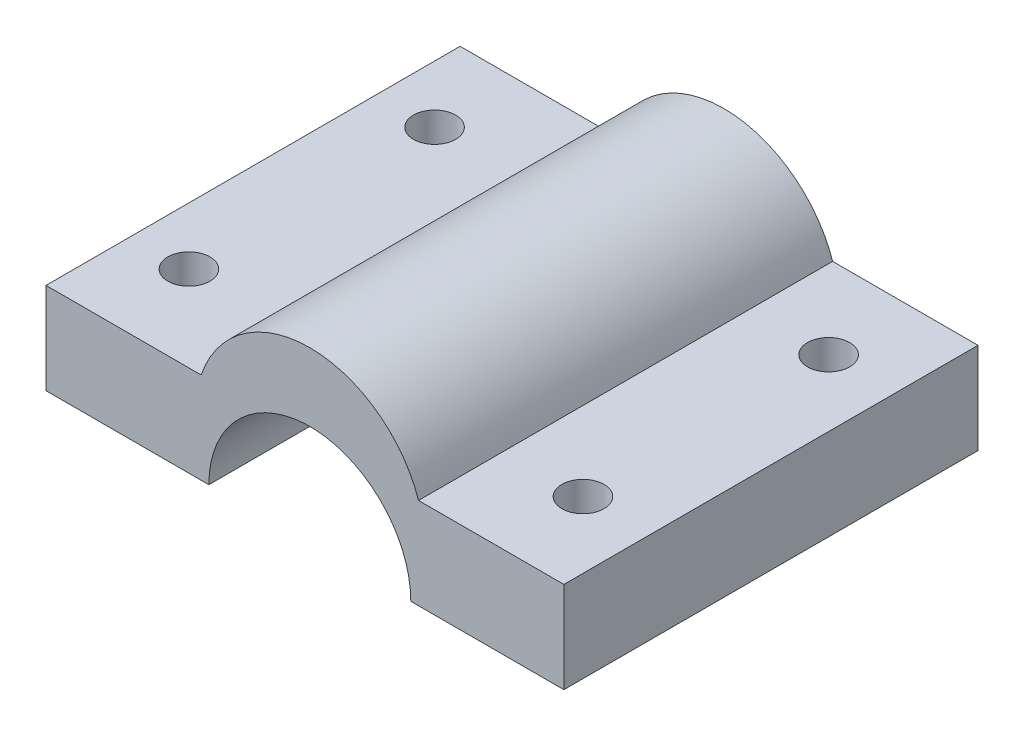
ISO-10303-21;
HEADER;
FILE_DESCRIPTION(('STEP AP214'),'2;1');
FILE_NAME('part.step','',(''),(''),'','','');
FILE_SCHEMA(('AUTOMOTIVE_DESIGN { 1 0 10303 214 1 1 1 1 }'));
ENDSEC;
DATA;
#1=APPLICATION_CONTEXT('core data for automotive mechanical design processes');
#2=APPLICATION_PROTOCOL_DEFINITION('international standard','automotive_design',2000,#1);
#3=PRODUCT_CONTEXT('',#1,'mechanical');
#4=PRODUCT('Part','Part','',(#3));
#5=PRODUCT_RELATED_PRODUCT_CATEGORY('part','',(#4));
#6=PRODUCT_DEFINITION_FORMATION('','',#4);
#7=PRODUCT_DEFINITION_CONTEXT('part definition',#1,'design');
#8=PRODUCT_DEFINITION('design','',#6,#7);
#9=PRODUCT_DEFINITION_SHAPE('','',#8);
#10=(LENGTH_UNIT() NAMED_UNIT(*) SI_UNIT(.MILLI.,.METRE.));
#11=(NAMED_UNIT(*) PLANE_ANGLE_UNIT() SI_UNIT($,.RADIAN.));
#12=(NAMED_UNIT(*) SI_UNIT($,.STERADIAN.) SOLID_ANGLE_UNIT());
#13=UNCERTAINTY_MEASURE_WITH_UNIT(LENGTH_MEASURE(1.E-05),#10,'distance_accuracy_value','');
#14=(GEOMETRIC_REPRESENTATION_CONTEXT(3) GLOBAL_UNCERTAINTY_ASSIGNED_CONTEXT((#13)) GLOBAL_UNIT_ASSIGNED_CONTEXT((#10,
#11,#12)) REPRESENTATION_CONTEXT('',''));
#15=CARTESIAN_POINT('',(0.,0.,0.));
#16=DIRECTION('',(0.,0.,1.));
#17=DIRECTION('',(1.,0.,0.));
#18=AXIS2_PLACEMENT_3D('',#15,#16,#17);
#19=CARTESIAN_POINT('',(-54.4931649896154,-25.7585610200364,50.));
#20=DIRECTION('',(1.,0.,0.));
#21=DIRECTION('',(0.,0.,-1.));
#22=AXIS2_PLACEMENT_3D('',#19,#20,#21);
#23=PLANE('',#22);
#24=DIRECTION('',(0.,-1.,0.));
#25=VECTOR('',#24,1.);
#26=CARTESIAN_POINT('',(-54.4931649896154,-25.7585610200364,0.));
#27=LINE('',#26,#25);
#28=CARTESIAN_POINT('',(-54.4931649896154,-14.7472677595628,0.));
#29=VERTEX_POINT('',#28);
#30=CARTESIAN_POINT('',(-54.4931649896154,-25.7585610200364,0.));
#31=VERTEX_POINT('',#30);
#32=EDGE_CURVE('E133',#29,#31,#27,.T.);
#33=ORIENTED_EDGE('',*,*,#32,.T.);
#34=DIRECTION('',(0.,0.,-1.));
#35=VECTOR('',#34,1.);
#36=CARTESIAN_POINT('',(-54.4931649896154,-25.7585610200364,50.));
#37=LINE('',#36,#35);
#38=CARTESIAN_POINT('',(-54.4931649896154,-25.7585610200364,50.));
#39=VERTEX_POINT('',#38);
#40=EDGE_CURVE('E11',#39,#31,#37,.T.);
#41=ORIENTED_EDGE('',*,*,#40,.F.);
#42=DIRECTION('',(0.,-1.,0.));
#43=VECTOR('',#42,1.);
#44=CARTESIAN_POINT('',(-54.4931649896154,-25.7585610200364,50.));
#45=LINE('',#44,#43);
#46=CARTESIAN_POINT('',(-54.4931649896154,-14.7472677595628,50.));
#47=VERTEX_POINT('',#46);
#48=EDGE_CURVE('E148',#47,#39,#45,.T.);
#49=ORIENTED_EDGE('',*,*,#48,.F.);
#50=DIRECTION('',(0.,0.,-1.));
#51=VECTOR('',#50,1.);
#52=CARTESIAN_POINT('',(-54.4931649896154,-14.7472677595628,50.));
#53=LINE('',#52,#51);
#54=EDGE_CURVE('E129',#47,#29,#53,.T.);
#55=ORIENTED_EDGE('',*,*,#54,.T.);
#56=EDGE_LOOP('',(#33,#41,#49,#55));
#57=FACE_BOUND('',#56,.T.);
#58=ADVANCED_FACE('F35',(#57),#23,.F.);
#59=CARTESIAN_POINT('',(-54.4931649896154,-25.7585610200364,50.));
#60=DIRECTION('',(0.,1.,0.));
#61=DIRECTION('',(0.,0.,1.));
#62=AXIS2_PLACEMENT_3D('',#59,#60,#61);
#63=PLANE('',#62);
#64=CARTESIAN_POINT('',(-47.5771142700678,-25.7585610200364,39.6642308787324));
#65=DIRECTION('',(0.,1.,0.));
#66=DIRECTION('',(0.,0.,1.));
#67=AXIS2_PLACEMENT_3D('',#64,#65,#66);
#68=CIRCLE('',#67,2.54548913366678);
#69=CARTESIAN_POINT('',(-47.5771142700678,-25.7585610200364,42.2097200123992));
#70=VERTEX_POINT('',#69);
#71=EDGE_CURVE('E166',#70,#70,#68,.T.);
#72=ORIENTED_EDGE('',*,*,#71,.T.);
#73=EDGE_LOOP('',(#72));
#74=FACE_BOUND('',#73,.T.);
#75=CARTESIAN_POINT('',(-47.5771142700678,-25.7585610200364,10.0037487994847));
#76=DIRECTION('',(0.,1.,0.));
#77=DIRECTION('',(0.,0.,1.));
#78=AXIS2_PLACEMENT_3D('',#75,#76,#77);
#79=CIRCLE('',#78,2.54548913366678);
#80=CARTESIAN_POINT('',(-47.5771142700678,-25.7585610200364,12.5492379331515));
#81=VERTEX_POINT('',#80);
#82=EDGE_CURVE('E163',#81,#81,#79,.T.);
#83=ORIENTED_EDGE('',*,*,#82,.T.);
#84=EDGE_LOOP('',(#83));
#85=FACE_BOUND('',#84,.T.);
#86=DIRECTION('',(1.,0.,0.));
#87=VECTOR('',#86,1.);
#88=CARTESIAN_POINT('',(-54.4931649896154,-25.7585610200364,0.));
#89=LINE('',#88,#87);
#90=CARTESIAN_POINT('',(-34.8301413101982,-25.7585610200364,0.));
#91=VERTEX_POINT('',#90);
#92=EDGE_CURVE('E136',#31,#91,#89,.T.);
#93=ORIENTED_EDGE('',*,*,#92,.T.);
#94=DIRECTION('',(0.,0.,-1.));
#95=VECTOR('',#94,1.);
#96=CARTESIAN_POINT('',(-34.8301413101982,-25.7585610200364,50.));
#97=LINE('',#96,#95);
#98=CARTESIAN_POINT('',(-34.8301413101982,-25.7585610200364,50.));
#99=VERTEX_POINT('',#98);
#100=EDGE_CURVE('E44',#99,#91,#97,.T.);
#101=ORIENTED_EDGE('',*,*,#100,.F.);
#102=DIRECTION('',(1.,0.,0.));
#103=VECTOR('',#102,1.);
#104=CARTESIAN_POINT('',(-54.4931649896154,-25.7585610200364,50.));
#105=LINE('',#104,#103);
#106=EDGE_CURVE('E96',#39,#99,#105,.T.);
#107=ORIENTED_EDGE('',*,*,#106,.F.);
#108=ORIENTED_EDGE('',*,*,#40,.T.);
#109=EDGE_LOOP('',(#93,#101,#107,#108));
#110=FACE_BOUND('',#109,.T.);
#111=ADVANCED_FACE('F217',(#74,#85,#110),#63,.F.);
#112=CARTESIAN_POINT('',(-22.6390666289596,-25.7585610200364,50.));
#113=DIRECTION('',(0.,0.,-1.));
#114=DIRECTION('',(-1.,0.,0.));
#115=AXIS2_PLACEMENT_3D('',#112,#113,#114);
#116=CYLINDRICAL_SURFACE('',#115,12.1910746812386);
#117=CARTESIAN_POINT('',(-22.6390666289596,-25.7585610200364,0.));
#118=DIRECTION('',(0.,0.,-1.));
#119=DIRECTION('',(-1.,0.,0.));
#120=AXIS2_PLACEMENT_3D('',#117,#118,#119);
#121=CIRCLE('',#120,12.1910746812386);
#122=CARTESIAN_POINT('',(-10.447991947721,-25.7585610200364,0.));
#123=VERTEX_POINT('',#122);
#124=EDGE_CURVE('E139',#91,#123,#121,.T.);
#125=ORIENTED_EDGE('',*,*,#124,.T.);
#126=DIRECTION('',(0.,0.,-1.));
#127=VECTOR('',#126,1.);
#128=CARTESIAN_POINT('',(-10.447991947721,-25.7585610200364,50.));
#129=LINE('',#128,#127);
#130=CARTESIAN_POINT('',(-10.447991947721,-25.7585610200364,50.));
#131=VERTEX_POINT('',#130);
#132=EDGE_CURVE('E155',#131,#123,#129,.T.);
#133=ORIENTED_EDGE('',*,*,#132,.F.);
#134=CARTESIAN_POINT('',(-22.6390666289596,-25.7585610200364,50.));
#135=DIRECTION('',(0.,0.,-1.));
#136=DIRECTION('',(-1.,0.,0.));
#137=AXIS2_PLACEMENT_3D('',#134,#135,#136);
#138=CIRCLE('',#137,12.1910746812386);
#139=EDGE_CURVE('E184',#99,#131,#138,.T.);
#140=ORIENTED_EDGE('',*,*,#139,.F.);
#141=ORIENTED_EDGE('',*,*,#100,.T.);
#142=EDGE_LOOP('',(#125,#133,#140,#141));
#143=FACE_BOUND('',#142,.T.);
#144=ADVANCED_FACE('F221',(#143),#116,.F.);
#145=CARTESIAN_POINT('',(-10.447991947721,-25.7585610200364,50.));
#146=DIRECTION('',(0.,1.,0.));
#147=DIRECTION('',(0.,0.,1.));
#148=AXIS2_PLACEMENT_3D('',#145,#146,#147);
#149=PLANE('',#148);
#150=CARTESIAN_POINT('',(0.,-25.7585610200364,39.6642308787324));
#151=DIRECTION('',(0.,1.,0.));
#152=DIRECTION('',(0.,0.,1.));
#153=AXIS2_PLACEMENT_3D('',#150,#151,#152);
#154=CIRCLE('',#153,2.54548913366678);
#155=CARTESIAN_POINT('',(0.,-25.7585610200364,42.2097200123992));
#156=VERTEX_POINT('',#155);
#157=EDGE_CURVE('E137',#156,#156,#154,.T.);
#158=ORIENTED_EDGE('',*,*,#157,.T.);
#159=EDGE_LOOP('',(#158));
#160=FACE_BOUND('',#159,.T.);
#161=CARTESIAN_POINT('',(0.,-25.7585610200364,10.0037487994847));
#162=DIRECTION('',(0.,1.,0.));
#163=DIRECTION('',(0.,0.,1.));
#164=AXIS2_PLACEMENT_3D('',#161,#162,#163);
#165=CIRCLE('',#164,2.54548913366678);
#166=CARTESIAN_POINT('',(0.,-25.7585610200364,12.5492379331515));
#167=VERTEX_POINT('',#166);
#168=EDGE_CURVE('E169',#167,#167,#165,.T.);
#169=ORIENTED_EDGE('',*,*,#168,.T.);
#170=EDGE_LOOP('',(#169));
#171=FACE_BOUND('',#170,.T.);
#172=DIRECTION('',(1.,0.,0.));
#173=VECTOR('',#172,1.);
#174=CARTESIAN_POINT('',(-10.447991947721,-25.7585610200364,0.));
#175=LINE('',#174,#173);
#176=CARTESIAN_POINT('',(8.03525031093111,-25.7585610200364,0.));
#177=VERTEX_POINT('',#176);
#178=EDGE_CURVE('E141',#123,#177,#175,.T.);
#179=ORIENTED_EDGE('',*,*,#178,.T.);
#180=DIRECTION('',(0.,0.,-1.));
#181=VECTOR('',#180,1.);
#182=CARTESIAN_POINT('',(8.03525031093111,-25.7585610200364,50.));
#183=LINE('',#182,#181);
#184=CARTESIAN_POINT('',(8.03525031093111,-25.7585610200364,50.));
#185=VERTEX_POINT('',#184);
#186=EDGE_CURVE('E152',#185,#177,#183,.T.);
#187=ORIENTED_EDGE('',*,*,#186,.F.);
#188=DIRECTION('',(1.,0.,0.));
#189=VECTOR('',#188,1.);
#190=CARTESIAN_POINT('',(-10.447991947721,-25.7585610200364,50.));
#191=LINE('',#190,#189);
#192=EDGE_CURVE('E186',#131,#185,#191,.T.);
#193=ORIENTED_EDGE('',*,*,#192,.F.);
#194=ORIENTED_EDGE('',*,*,#132,.T.);
#195=EDGE_LOOP('',(#179,#187,#193,#194));
#196=FACE_BOUND('',#195,.T.);
#197=ADVANCED_FACE('F192',(#160,#171,#196),#149,.F.);
#198=CARTESIAN_POINT('',(8.03525031093111,-25.7585610200364,50.));
#199=DIRECTION('',(-1.,0.,0.));
#200=DIRECTION('',(0.,0.,1.));
#201=AXIS2_PLACEMENT_3D('',#198,#199,#200);
#202=PLANE('',#201);
#203=DIRECTION('',(0.,1.,0.));
#204=VECTOR('',#203,1.);
#205=CARTESIAN_POINT('',(8.03525031093111,-25.7585610200364,0.));
#206=LINE('',#205,#204);
#207=CARTESIAN_POINT('',(8.03525031093111,-14.7472677595628,0.));
#208=VERTEX_POINT('',#207);
#209=EDGE_CURVE('E143',#177,#208,#206,.T.);
#210=ORIENTED_EDGE('',*,*,#209,.T.);
#211=DIRECTION('',(0.,0.,-1.));
#212=VECTOR('',#211,1.);
#213=CARTESIAN_POINT('',(8.03525031093111,-14.7472677595628,50.));
#214=LINE('',#213,#212);
#215=CARTESIAN_POINT('',(8.03525031093111,-14.7472677595628,50.));
#216=VERTEX_POINT('',#215);
#217=EDGE_CURVE('E124',#216,#208,#214,.T.);
#218=ORIENTED_EDGE('',*,*,#217,.F.);
#219=DIRECTION('',(0.,1.,0.));
#220=VECTOR('',#219,1.);
#221=CARTESIAN_POINT('',(8.03525031093111,-25.7585610200364,50.));
#222=LINE('',#221,#220);
#223=EDGE_CURVE('E115',#185,#216,#222,.T.);
#224=ORIENTED_EDGE('',*,*,#223,.F.);
#225=ORIENTED_EDGE('',*,*,#186,.T.);
#226=EDGE_LOOP('',(#210,#218,#224,#225));
#227=FACE_BOUND('',#226,.T.);
#228=ADVANCED_FACE('F196',(#227),#202,.F.);
#229=CARTESIAN_POINT('',(-9.51623722177817,-14.7472677595628,50.));
#230=DIRECTION('',(0.,-1.,0.));
#231=DIRECTION('',(0.,0.,-1.));
#232=AXIS2_PLACEMENT_3D('',#229,#230,#231);
#233=PLANE('',#232);
#234=CARTESIAN_POINT('',(0.,-14.7472677595628,39.6642308787324));
#235=DIRECTION('',(0.,-1.,0.));
#236=DIRECTION('',(0.,0.,-1.));
#237=AXIS2_PLACEMENT_3D('',#234,#235,#236);
#238=CIRCLE('',#237,2.54548913366678);
#239=CARTESIAN_POINT('',(0.,-14.7472677595628,37.1187417450656));
#240=VERTEX_POINT('',#239);
#241=EDGE_CURVE('E38',#240,#240,#238,.T.);
#242=ORIENTED_EDGE('',*,*,#241,.T.);
#243=EDGE_LOOP('',(#242));
#244=FACE_BOUND('',#243,.T.);
#245=CARTESIAN_POINT('',(0.,-14.7472677595628,10.0037487994847));
#246=DIRECTION('',(0.,-1.,0.));
#247=DIRECTION('',(0.,0.,-1.));
#248=AXIS2_PLACEMENT_3D('',#245,#246,#247);
#249=CIRCLE('',#248,2.54548913366678);
#250=CARTESIAN_POINT('',(0.,-14.7472677595628,7.45825966581795));
#251=VERTEX_POINT('',#250);
#252=EDGE_CURVE('E167',#251,#251,#249,.T.);
#253=ORIENTED_EDGE('',*,*,#252,.T.);
#254=EDGE_LOOP('',(#253));
#255=FACE_BOUND('',#254,.T.);
#256=DIRECTION('',(-1.,0.,0.));
#257=VECTOR('',#256,1.);
#258=CARTESIAN_POINT('',(-9.51623722177817,-14.7472677595628,0.));
#259=LINE('',#258,#257);
#260=CARTESIAN_POINT('',(-9.51623722177817,-14.7472677595628,0.));
#261=VERTEX_POINT('',#260);
#262=EDGE_CURVE('E123',#208,#261,#259,.T.);
#263=ORIENTED_EDGE('',*,*,#262,.T.);
#264=DIRECTION('',(0.,0.,-1.));
#265=VECTOR('',#264,1.);
#266=CARTESIAN_POINT('',(-9.51623722177817,-14.7472677595628,50.));
#267=LINE('',#266,#265);
#268=CARTESIAN_POINT('',(-9.51623722177817,-14.7472677595628,50.));
#269=VERTEX_POINT('',#268);
#270=EDGE_CURVE('E120',#269,#261,#267,.T.);
#271=ORIENTED_EDGE('',*,*,#270,.F.);
#272=DIRECTION('',(-1.,0.,0.));
#273=VECTOR('',#272,1.);
#274=CARTESIAN_POINT('',(-9.51623722177817,-14.7472677595628,50.));
#275=LINE('',#274,#273);
#276=EDGE_CURVE('E109',#216,#269,#275,.T.);
#277=ORIENTED_EDGE('',*,*,#276,.F.);
#278=ORIENTED_EDGE('',*,*,#217,.T.);
#279=EDGE_LOOP('',(#263,#271,#277,#278));
#280=FACE_BOUND('',#279,.T.);
#281=ADVANCED_FACE('F121',(#244,#255,#280),#233,.F.);
#282=CARTESIAN_POINT('',(-22.6390666289596,-19.1819071425803,50.));
#283=DIRECTION('',(0.,0.,-1.));
#284=DIRECTION('',(-1.,0.,0.));
#285=AXIS2_PLACEMENT_3D('',#282,#283,#284);
#286=CYLINDRICAL_SURFACE('',#285,13.8518835581085);
#287=CARTESIAN_POINT('',(-22.6390666289596,-19.1819071425803,0.));
#288=DIRECTION('',(0.,0.,1.));
#289=DIRECTION('',(-1.,0.,0.));
#290=AXIS2_PLACEMENT_3D('',#287,#288,#289);
#291=CIRCLE('',#290,13.8518835581085);
#292=CARTESIAN_POINT('',(-35.7618960361411,-14.7472677595628,0.));
#293=VERTEX_POINT('',#292);
#294=EDGE_CURVE('E82',#261,#293,#291,.T.);
#295=ORIENTED_EDGE('',*,*,#294,.T.);
#296=DIRECTION('',(0.,0.,-1.));
#297=VECTOR('',#296,1.);
#298=CARTESIAN_POINT('',(-35.7618960361411,-14.7472677595628,50.));
#299=LINE('',#298,#297);
#300=CARTESIAN_POINT('',(-35.7618960361411,-14.7472677595628,50.));
#301=VERTEX_POINT('',#300);
#302=EDGE_CURVE('E125',#301,#293,#299,.T.);
#303=ORIENTED_EDGE('',*,*,#302,.F.);
#304=CARTESIAN_POINT('',(-22.6390666289596,-19.1819071425803,50.));
#305=DIRECTION('',(0.,0.,1.));
#306=DIRECTION('',(-1.,0.,0.));
#307=AXIS2_PLACEMENT_3D('',#304,#305,#306);
#308=CIRCLE('',#307,13.8518835581085);
#309=EDGE_CURVE('E113',#269,#301,#308,.T.);
#310=ORIENTED_EDGE('',*,*,#309,.F.);
#311=ORIENTED_EDGE('',*,*,#270,.T.);
#312=EDGE_LOOP('',(#295,#303,#310,#311));
#313=FACE_BOUND('',#312,.T.);
#314=ADVANCED_FACE('F127',(#313),#286,.T.);
#315=CARTESIAN_POINT('',(-54.4931649896154,-14.7472677595628,50.));
#316=DIRECTION('',(0.,-1.,0.));
#317=DIRECTION('',(0.,0.,-1.));
#318=AXIS2_PLACEMENT_3D('',#315,#316,#317);
#319=PLANE('',#318);
#320=CARTESIAN_POINT('',(-47.5771142700678,-14.7472677595628,39.6642308787324));
#321=DIRECTION('',(0.,-1.,0.));
#322=DIRECTION('',(0.,0.,-1.));
#323=AXIS2_PLACEMENT_3D('',#320,#321,#322);
#324=CIRCLE('',#323,2.54548913366678);
#325=CARTESIAN_POINT('',(-47.5771142700678,-14.7472677595628,37.1187417450656));
#326=VERTEX_POINT('',#325);
#327=EDGE_CURVE('E164',#326,#326,#324,.T.);
#328=ORIENTED_EDGE('',*,*,#327,.T.);
#329=EDGE_LOOP('',(#328));
#330=FACE_BOUND('',#329,.T.);
#331=CARTESIAN_POINT('',(-47.5771142700678,-14.7472677595628,10.0037487994847));
#332=DIRECTION('',(0.,-1.,0.));
#333=DIRECTION('',(0.,0.,-1.));
#334=AXIS2_PLACEMENT_3D('',#331,#332,#333);
#335=CIRCLE('',#334,2.54548913366678);
#336=CARTESIAN_POINT('',(-47.5771142700678,-14.7472677595628,7.45825966581794));
#337=VERTEX_POINT('',#336);
#338=EDGE_CURVE('E160',#337,#337,#335,.T.);
#339=ORIENTED_EDGE('',*,*,#338,.T.);
#340=EDGE_LOOP('',(#339));
#341=FACE_BOUND('',#340,.T.);
#342=DIRECTION('',(-1.,0.,0.));
#343=VECTOR('',#342,1.);
#344=CARTESIAN_POINT('',(-54.4931649896154,-14.7472677595628,0.));
#345=LINE('',#344,#343);
#346=EDGE_CURVE('E88',#293,#29,#345,.T.);
#347=ORIENTED_EDGE('',*,*,#346,.T.);
#348=ORIENTED_EDGE('',*,*,#54,.F.);
#349=DIRECTION('',(-1.,0.,0.));
#350=VECTOR('',#349,1.);
#351=CARTESIAN_POINT('',(-54.4931649896154,-14.7472677595628,50.));
#352=LINE('',#351,#350);
#353=EDGE_CURVE('E53',#301,#47,#352,.T.);
#354=ORIENTED_EDGE('',*,*,#353,.F.);
#355=ORIENTED_EDGE('',*,*,#302,.T.);
#356=EDGE_LOOP('',(#347,#348,#354,#355));
#357=FACE_BOUND('',#356,.T.);
#358=ADVANCED_FACE('F204',(#330,#341,#357),#319,.F.);
#359=CARTESIAN_POINT('',(-22.6390666289596,-19.1819071425803,50.));
#360=DIRECTION('',(0.,0.,-1.));
#361=DIRECTION('',(-1.,0.,0.));
#362=AXIS2_PLACEMENT_3D('',#359,#360,#361);
#363=PLANE('',#362);
#364=ORIENTED_EDGE('',*,*,#48,.T.);
#365=ORIENTED_EDGE('',*,*,#106,.T.);
#366=ORIENTED_EDGE('',*,*,#139,.T.);
#367=ORIENTED_EDGE('',*,*,#192,.T.);
#368=ORIENTED_EDGE('',*,*,#223,.T.);
#369=ORIENTED_EDGE('',*,*,#276,.T.);
#370=ORIENTED_EDGE('',*,*,#309,.T.);
#371=ORIENTED_EDGE('',*,*,#353,.T.);
#372=EDGE_LOOP('',(#364,#365,#366,#367,#368,#369,#370,#371));
#373=FACE_BOUND('',#372,.T.);
#374=ADVANCED_FACE('F111',(#373),#363,.F.);
#375=CARTESIAN_POINT('',(-22.6390666289596,-19.1819071425803,0.));
#376=DIRECTION('',(0.,0.,-1.));
#377=DIRECTION('',(-1.,0.,0.));
#378=AXIS2_PLACEMENT_3D('',#375,#376,#377);
#379=PLANE('',#378);
#380=ORIENTED_EDGE('',*,*,#32,.F.);
#381=ORIENTED_EDGE('',*,*,#346,.F.);
#382=ORIENTED_EDGE('',*,*,#294,.F.);
#383=ORIENTED_EDGE('',*,*,#262,.F.);
#384=ORIENTED_EDGE('',*,*,#209,.F.);
#385=ORIENTED_EDGE('',*,*,#178,.F.);
#386=ORIENTED_EDGE('',*,*,#124,.F.);
#387=ORIENTED_EDGE('',*,*,#92,.F.);
#388=EDGE_LOOP('',(#380,#381,#382,#383,#384,#385,#386,#387));
#389=FACE_BOUND('',#388,.T.);
#390=ADVANCED_FACE('F199',(#389),#379,.T.);
#391=CARTESIAN_POINT('',(-47.5771142700678,-50.,10.0037487994847));
#392=DIRECTION('',(0.,1.,0.));
#393=DIRECTION('',(0.,0.,1.));
#394=AXIS2_PLACEMENT_3D('',#391,#392,#393);
#395=CYLINDRICAL_SURFACE('',#394,2.54548913366678);
#396=ORIENTED_EDGE('',*,*,#338,.F.);
#397=EDGE_LOOP('',(#396));
#398=FACE_BOUND('',#397,.T.);
#399=ORIENTED_EDGE('',*,*,#82,.F.);
#400=EDGE_LOOP('',(#399));
#401=FACE_BOUND('',#400,.T.);
#402=ADVANCED_FACE('F257',(#398,#401),#395,.F.);
#403=CARTESIAN_POINT('',(-47.5771142700678,-50.,39.6642308787324));
#404=DIRECTION('',(0.,1.,0.));
#405=DIRECTION('',(0.,0.,1.));
#406=AXIS2_PLACEMENT_3D('',#403,#404,#405);
#407=CYLINDRICAL_SURFACE('',#406,2.54548913366678);
#408=ORIENTED_EDGE('',*,*,#327,.F.);
#409=EDGE_LOOP('',(#408));
#410=FACE_BOUND('',#409,.T.);
#411=ORIENTED_EDGE('',*,*,#71,.F.);
#412=EDGE_LOOP('',(#411));
#413=FACE_BOUND('',#412,.T.);
#414=ADVANCED_FACE('F251',(#410,#413),#407,.F.);
#415=CARTESIAN_POINT('',(0.,-50.,10.0037487994847));
#416=DIRECTION('',(0.,1.,0.));
#417=DIRECTION('',(0.,0.,1.));
#418=AXIS2_PLACEMENT_3D('',#415,#416,#417);
#419=CYLINDRICAL_SURFACE('',#418,2.54548913366678);
#420=ORIENTED_EDGE('',*,*,#252,.F.);
#421=EDGE_LOOP('',(#420));
#422=FACE_BOUND('',#421,.T.);
#423=ORIENTED_EDGE('',*,*,#168,.F.);
#424=EDGE_LOOP('',(#423));
#425=FACE_BOUND('',#424,.T.);
#426=ADVANCED_FACE('F244',(#422,#425),#419,.F.);
#427=CARTESIAN_POINT('',(0.,-50.,39.6642308787324));
#428=DIRECTION('',(0.,1.,0.));
#429=DIRECTION('',(0.,0.,1.));
#430=AXIS2_PLACEMENT_3D('',#427,#428,#429);
#431=CYLINDRICAL_SURFACE('',#430,2.54548913366678);
#432=ORIENTED_EDGE('',*,*,#241,.F.);
#433=EDGE_LOOP('',(#432));
#434=FACE_BOUND('',#433,.T.);
#435=ORIENTED_EDGE('',*,*,#157,.F.);
#436=EDGE_LOOP('',(#435));
#437=FACE_BOUND('',#436,.T.);
#438=ADVANCED_FACE('F241',(#434,#437),#431,.F.);
#439=CLOSED_SHELL('',(#58,#111,#144,#197,#228,#281,#314,#358,#374,#390,#402,#414,#426,#438));
#440=MANIFOLD_SOLID_BREP('B2',#439);
#441=ADVANCED_BREP_SHAPE_REPRESENTATION('',(#18,#440),#14);
#442=SHAPE_DEFINITION_REPRESENTATION(#9,#441);
ENDSEC;
END-ISO-10303-21;
